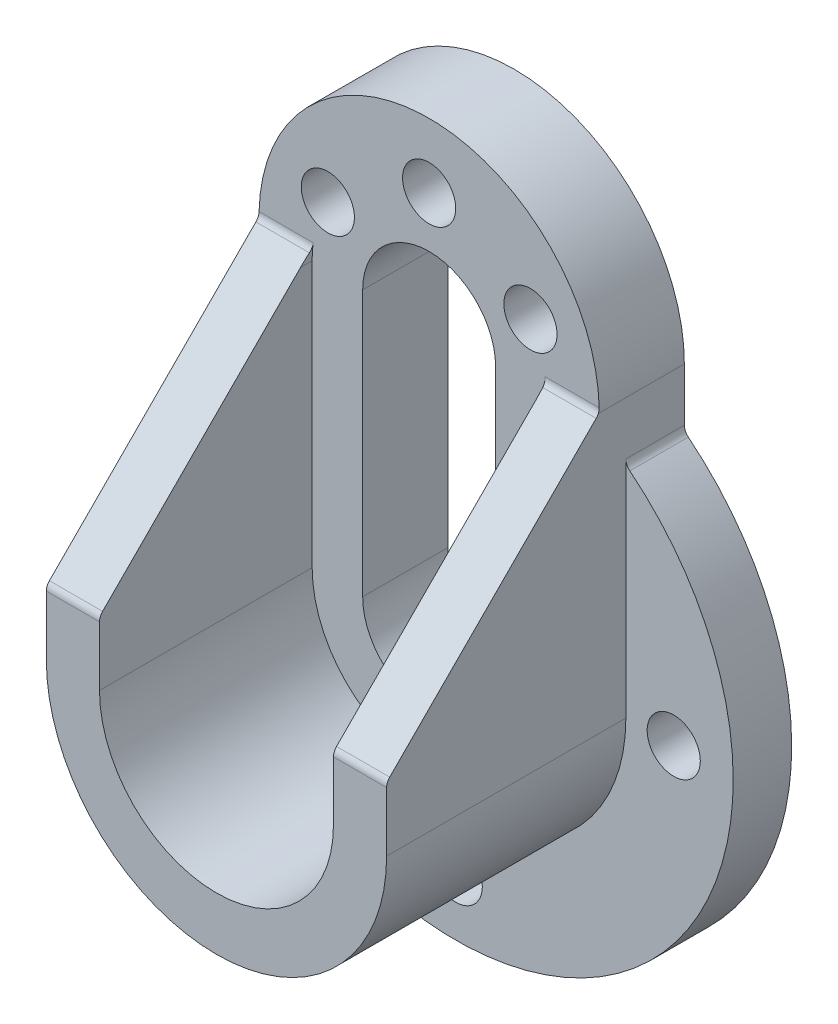
ISO-10303-21;
HEADER;
FILE_DESCRIPTION(('STEP AP214'),'2;1');
FILE_NAME('part.step','',(''),(''),'','','');
FILE_SCHEMA(('AUTOMOTIVE_DESIGN { 1 0 10303 214 1 1 1 1 }'));
ENDSEC;
DATA;
#1=APPLICATION_CONTEXT('core data for automotive mechanical design processes');
#2=APPLICATION_PROTOCOL_DEFINITION('international standard','automotive_design',2000,#1);
#3=PRODUCT_CONTEXT('',#1,'mechanical');
#4=PRODUCT('Part','Part','',(#3));
#5=PRODUCT_RELATED_PRODUCT_CATEGORY('part','',(#4));
#6=PRODUCT_DEFINITION_FORMATION('','',#4);
#7=PRODUCT_DEFINITION_CONTEXT('part definition',#1,'design');
#8=PRODUCT_DEFINITION('design','',#6,#7);
#9=PRODUCT_DEFINITION_SHAPE('','',#8);
#10=(LENGTH_UNIT() NAMED_UNIT(*) SI_UNIT(.MILLI.,.METRE.));
#11=(NAMED_UNIT(*) PLANE_ANGLE_UNIT() SI_UNIT($,.RADIAN.));
#12=(NAMED_UNIT(*) SI_UNIT($,.STERADIAN.) SOLID_ANGLE_UNIT());
#13=UNCERTAINTY_MEASURE_WITH_UNIT(LENGTH_MEASURE(1.E-05),#10,'distance_accuracy_value','');
#14=(GEOMETRIC_REPRESENTATION_CONTEXT(3) GLOBAL_UNCERTAINTY_ASSIGNED_CONTEXT((#13)) GLOBAL_UNIT_ASSIGNED_CONTEXT((#10,
#11,#12)) REPRESENTATION_CONTEXT('',''));
#15=CARTESIAN_POINT('',(0.,0.,0.));
#16=DIRECTION('',(0.,0.,1.));
#17=DIRECTION('',(1.,0.,0.));
#18=AXIS2_PLACEMENT_3D('',#15,#16,#17);
#19=CARTESIAN_POINT('',(0.,50.,0.));
#20=DIRECTION('',(0.,0.,1.));
#21=DIRECTION('',(1.,0.,0.));
#22=AXIS2_PLACEMENT_3D('',#19,#20,#21);
#23=CYLINDRICAL_SURFACE('',#22,22.);
#24=DIRECTION('',(0.,0.,1.));
#25=VECTOR('',#24,1.);
#26=CARTESIAN_POINT('',(22.,50.,0.));
#27=LINE('',#26,#25);
#28=CARTESIAN_POINT('',(22.,50.,0.));
#29=VERTEX_POINT('',#28);
#30=CARTESIAN_POINT('',(22.,50.,2.17761140897928));
#31=VERTEX_POINT('',#30);
#32=EDGE_CURVE('E220',#29,#31,#27,.T.);
#33=ORIENTED_EDGE('',*,*,#32,.T.);
#34=CARTESIAN_POINT('',(0.,50.,2.17761140897929));
#35=DIRECTION('',(0.,-0.705448471756706,-0.70876121063171));
#36=DIRECTION('',(0.,-0.70876121063171,0.705448471756706));
#37=AXIS2_PLACEMENT_3D('',#34,#35,#36);
#38=ELLIPSE('',#37,31.0400733984746,22.);
#39=CARTESIAN_POINT('',(21.9415495077587,51.6026244720994,0.582477578736564));
#40=VERTEX_POINT('',#39);
#41=EDGE_CURVE('E206',#31,#40,#38,.F.);
#42=ORIENTED_EDGE('',*,*,#41,.T.);
#43=CARTESIAN_POINT('',(21.9415495077587,51.6026244720994,0.582477578736581));
#44=CARTESIAN_POINT('',(21.9386403688496,51.6424531020536,0.542835848804801));
#45=CARTESIAN_POINT('',(21.9355020785693,51.6839247776312,0.504901144272656));
#46=CARTESIAN_POINT('',(21.9287339390922,51.7698845092516,0.432670223736206));
#47=CARTESIAN_POINT('',(21.9251041047282,51.8143724742544,0.398373897995576));
#48=CARTESIAN_POINT('',(21.9134315652484,51.951907670187,0.301312631195397));
#49=CARTESIAN_POINT('',(21.9046025785488,52.0490722840365,0.244329639346155));
#50=CARTESIAN_POINT('',(21.8847360056665,52.2513726203151,0.147504672207877));
#51=CARTESIAN_POINT('',(21.873697122173,52.3565130022624,0.107672808899073));
#52=CARTESIAN_POINT('',(21.8494486585541,52.5716228820764,0.0462377916142625));
#53=CARTESIAN_POINT('',(21.8362431988387,52.6815829284529,0.0246005044872213));
#54=CARTESIAN_POINT('',(21.8173707897701,52.8290856105941,0.00817637818528167));
#55=CARTESIAN_POINT('',(21.8125587418083,52.8659507637769,0.00510811691843141));
#56=CARTESIAN_POINT('',(21.8027392904783,52.9397169475892,0.00102244721047741));
#57=CARTESIAN_POINT('',(21.7977321648536,52.9766178591679,2.22433321546773E-06));
#58=CARTESIAN_POINT('',(21.7926292281965,53.0135214156128,0.));
#59=B_SPLINE_CURVE_WITH_KNOTS('',3,(#43,#44,#45,#46,#47,#48,#49,#50,#51,#52,#53,#54,#55,#56,#57,
#58),.UNSPECIFIED.,.F.,.F.,(4,2,2,2,2,2,2,4),(0.,0.168702836620993,0.337400583586161,
0.674603490869276,1.01200493527835,1.34877199108211,1.46064422207649,1.57236261152918),.UNSPECIFIED.);
#60=CARTESIAN_POINT('',(21.7926292281965,53.0135214156128,0.));
#61=VERTEX_POINT('',#60);
#62=EDGE_CURVE('E356',#40,#61,#59,.T.);
#63=ORIENTED_EDGE('',*,*,#62,.T.);
#64=CARTESIAN_POINT('',(0.,50.,0.));
#65=DIRECTION('',(0.,0.,1.));
#66=DIRECTION('',(1.,0.,0.));
#67=AXIS2_PLACEMENT_3D('',#64,#65,#66);
#68=CIRCLE('',#67,22.);
#69=EDGE_CURVE('E434',#29,#61,#68,.T.);
#70=ORIENTED_EDGE('',*,*,#69,.F.);
#71=EDGE_LOOP('',(#33,#42,#63,#70));
#72=FACE_BOUND('',#71,.T.);
#73=ADVANCED_FACE('F35',(#72),#23,.F.);
#74=CARTESIAN_POINT('',(0.,0.,-16.));
#75=DIRECTION('',(0.,0.,1.));
#76=DIRECTION('',(1.,0.,0.));
#77=AXIS2_PLACEMENT_3D('',#74,#75,#76);
#78=CYLINDRICAL_SURFACE('',#77,12.5);
#79=CARTESIAN_POINT('',(0.,0.,0.));
#80=DIRECTION('',(0.,0.,1.));
#81=DIRECTION('',(1.,0.,0.));
#82=AXIS2_PLACEMENT_3D('',#79,#80,#81);
#83=CIRCLE('',#82,12.5);
#84=CARTESIAN_POINT('',(12.5,0.,0.));
#85=VERTEX_POINT('',#84);
#86=CARTESIAN_POINT('',(-12.5,0.,0.));
#87=VERTEX_POINT('',#86);
#88=EDGE_CURVE('E235',#85,#87,#83,.F.);
#89=ORIENTED_EDGE('',*,*,#88,.F.);
#90=DIRECTION('',(0.,0.,1.));
#91=VECTOR('',#90,1.);
#92=CARTESIAN_POINT('',(12.5,0.,-16.));
#93=LINE('',#92,#91);
#94=CARTESIAN_POINT('',(12.5,0.,-16.));
#95=VERTEX_POINT('',#94);
#96=EDGE_CURVE('E249',#95,#85,#93,.T.);
#97=ORIENTED_EDGE('',*,*,#96,.F.);
#98=CARTESIAN_POINT('',(0.,0.,-16.));
#99=DIRECTION('',(0.,0.,1.));
#100=DIRECTION('',(1.,0.,0.));
#101=AXIS2_PLACEMENT_3D('',#98,#99,#100);
#102=CIRCLE('',#101,12.5);
#103=CARTESIAN_POINT('',(-12.5,0.,-16.));
#104=VERTEX_POINT('',#103);
#105=EDGE_CURVE('E237',#104,#95,#102,.T.);
#106=ORIENTED_EDGE('',*,*,#105,.F.);
#107=DIRECTION('',(0.,0.,1.));
#108=VECTOR('',#107,1.);
#109=CARTESIAN_POINT('',(-12.5,0.,-16.));
#110=LINE('',#109,#108);
#111=EDGE_CURVE('E250',#104,#87,#110,.T.);
#112=ORIENTED_EDGE('',*,*,#111,.T.);
#113=EDGE_LOOP('',(#89,#97,#106,#112));
#114=FACE_BOUND('',#113,.T.);
#115=ADVANCED_FACE('F386',(#114),#78,.F.);
#116=CARTESIAN_POINT('',(-12.5,0.,-16.));
#117=DIRECTION('',(-1.,0.,0.));
#118=DIRECTION('',(0.,0.,1.));
#119=AXIS2_PLACEMENT_3D('',#116,#117,#118);
#120=PLANE('',#119);
#121=DIRECTION('',(0.,1.,0.));
#122=VECTOR('',#121,1.);
#123=CARTESIAN_POINT('',(-12.5,0.,0.));
#124=LINE('',#123,#122);
#125=CARTESIAN_POINT('',(-12.5,50.,0.));
#126=VERTEX_POINT('',#125);
#127=EDGE_CURVE('E233',#87,#126,#124,.T.);
#128=ORIENTED_EDGE('',*,*,#127,.F.);
#129=ORIENTED_EDGE('',*,*,#111,.F.);
#130=DIRECTION('',(0.,-1.,0.));
#131=VECTOR('',#130,1.);
#132=CARTESIAN_POINT('',(-12.5,0.,-16.));
#133=LINE('',#132,#131);
#134=CARTESIAN_POINT('',(-12.5,50.,-16.));
#135=VERTEX_POINT('',#134);
#136=EDGE_CURVE('E246',#135,#104,#133,.T.);
#137=ORIENTED_EDGE('',*,*,#136,.F.);
#138=DIRECTION('',(0.,0.,1.));
#139=VECTOR('',#138,1.);
#140=CARTESIAN_POINT('',(-12.5,50.,-16.));
#141=LINE('',#140,#139);
#142=EDGE_CURVE('E254',#135,#126,#141,.T.);
#143=ORIENTED_EDGE('',*,*,#142,.T.);
#144=EDGE_LOOP('',(#128,#129,#137,#143));
#145=FACE_BOUND('',#144,.T.);
#146=ADVANCED_FACE('F382',(#145),#120,.F.);
#147=CARTESIAN_POINT('',(0.,50.,-16.));
#148=DIRECTION('',(0.,0.,1.));
#149=DIRECTION('',(1.,0.,0.));
#150=AXIS2_PLACEMENT_3D('',#147,#148,#149);
#151=CYLINDRICAL_SURFACE('',#150,12.5);
#152=CARTESIAN_POINT('',(0.,50.,0.));
#153=DIRECTION('',(0.,0.,1.));
#154=DIRECTION('',(1.,0.,0.));
#155=AXIS2_PLACEMENT_3D('',#152,#153,#154);
#156=CIRCLE('',#155,12.5);
#157=CARTESIAN_POINT('',(12.5,50.,0.));
#158=VERTEX_POINT('',#157);
#159=EDGE_CURVE('E223',#126,#158,#156,.F.);
#160=ORIENTED_EDGE('',*,*,#159,.F.);
#161=ORIENTED_EDGE('',*,*,#142,.F.);
#162=CARTESIAN_POINT('',(0.,50.,-16.));
#163=DIRECTION('',(0.,0.,1.));
#164=DIRECTION('',(1.,0.,0.));
#165=AXIS2_PLACEMENT_3D('',#162,#163,#164);
#166=CIRCLE('',#165,12.5);
#167=CARTESIAN_POINT('',(12.5,50.,-16.));
#168=VERTEX_POINT('',#167);
#169=EDGE_CURVE('E243',#168,#135,#166,.T.);
#170=ORIENTED_EDGE('',*,*,#169,.F.);
#171=DIRECTION('',(0.,0.,1.));
#172=VECTOR('',#171,1.);
#173=CARTESIAN_POINT('',(12.5,50.,-16.));
#174=LINE('',#173,#172);
#175=EDGE_CURVE('E257',#168,#158,#174,.T.);
#176=ORIENTED_EDGE('',*,*,#175,.T.);
#177=EDGE_LOOP('',(#160,#161,#170,#176));
#178=FACE_BOUND('',#177,.T.);
#179=ADVANCED_FACE('F385',(#178),#151,.F.);
#180=CARTESIAN_POINT('',(12.5,0.,-16.));
#181=DIRECTION('',(1.,0.,0.));
#182=DIRECTION('',(0.,0.,-1.));
#183=AXIS2_PLACEMENT_3D('',#180,#181,#182);
#184=PLANE('',#183);
#185=DIRECTION('',(0.,-1.,0.));
#186=VECTOR('',#185,1.);
#187=CARTESIAN_POINT('',(12.5,0.,0.));
#188=LINE('',#187,#186);
#189=EDGE_CURVE('E299',#158,#85,#188,.T.);
#190=ORIENTED_EDGE('',*,*,#189,.F.);
#191=ORIENTED_EDGE('',*,*,#175,.F.);
#192=DIRECTION('',(0.,1.,0.));
#193=VECTOR('',#192,1.);
#194=CARTESIAN_POINT('',(12.5,0.,-16.));
#195=LINE('',#194,#193);
#196=EDGE_CURVE('E240',#95,#168,#195,.T.);
#197=ORIENTED_EDGE('',*,*,#196,.F.);
#198=ORIENTED_EDGE('',*,*,#96,.T.);
#199=EDGE_LOOP('',(#190,#191,#197,#198));
#200=FACE_BOUND('',#199,.T.);
#201=ADVANCED_FACE('F390',(#200),#184,.F.);
#202=CARTESIAN_POINT('',(32.,0.,40.));
#203=DIRECTION('',(-1.,0.,0.));
#204=DIRECTION('',(0.,0.,1.));
#205=AXIS2_PLACEMENT_3D('',#202,#203,#204);
#206=PLANE('',#205);
#207=DIRECTION('',(0.,1.,0.));
#208=VECTOR('',#207,1.);
#209=CARTESIAN_POINT('',(32.,0.,-5.));
#210=LINE('',#209,#208);
#211=CARTESIAN_POINT('',(32.,0.,-5.));
#212=VERTEX_POINT('',#211);
#213=CARTESIAN_POINT('',(32.,42.193858725362,-5.));
#214=VERTEX_POINT('',#213);
#215=EDGE_CURVE('E50',#212,#214,#210,.T.);
#216=ORIENTED_EDGE('',*,*,#215,.T.);
#217=DIRECTION('',(0.,0.,1.));
#218=VECTOR('',#217,1.);
#219=CARTESIAN_POINT('',(32.,42.193858725362,40.));
#220=LINE('',#219,#218);
#221=CARTESIAN_POINT('',(32.,42.193858725362,-16.));
#222=VERTEX_POINT('',#221);
#223=EDGE_CURVE('E500',#214,#222,#220,.F.);
#224=ORIENTED_EDGE('',*,*,#223,.T.);
#225=DIRECTION('',(0.,1.,0.));
#226=VECTOR('',#225,1.);
#227=CARTESIAN_POINT('',(32.,0.,-16.));
#228=LINE('',#227,#226);
#229=CARTESIAN_POINT('',(32.,52.1878373266161,-16.));
#230=VERTEX_POINT('',#229);
#231=EDGE_CURVE('E270',#222,#230,#228,.T.);
#232=ORIENTED_EDGE('',*,*,#231,.T.);
#233=DIRECTION('',(0.,0.,-1.));
#234=VECTOR('',#233,1.);
#235=CARTESIAN_POINT('',(32.,52.1878373266161,40.));
#236=LINE('',#235,#234);
#237=CARTESIAN_POINT('',(32.,52.1878373266161,0.178394723004564));
#238=VERTEX_POINT('',#237);
#239=EDGE_CURVE('E293',#238,#230,#236,.T.);
#240=ORIENTED_EDGE('',*,*,#239,.F.);
#241=CARTESIAN_POINT('',(32.,53.0135214156128,2.));
#242=DIRECTION('',(-1.,0.,0.));
#243=DIRECTION('',(0.,0.,1.));
#244=AXIS2_PLACEMENT_3D('',#241,#242,#243);
#245=CIRCLE('',#244,2.);
#246=CARTESIAN_POINT('',(32.,51.6026244720994,0.582477578736581));
#247=VERTEX_POINT('',#246);
#248=EDGE_CURVE('E338',#238,#247,#245,.T.);
#249=ORIENTED_EDGE('',*,*,#248,.T.);
#250=DIRECTION('',(0.,0.70876121063171,-0.705448471756706));
#251=VECTOR('',#250,1.);
#252=CARTESIAN_POINT('',(32.,52.1878373266161,0.));
#253=LINE('',#252,#251);
#254=CARTESIAN_POINT('',(32.,12.5852128545167,39.4175224212634));
#255=VERTEX_POINT('',#254);
#256=EDGE_CURVE('E447',#255,#247,#253,.T.);
#257=ORIENTED_EDGE('',*,*,#256,.F.);
#258=CARTESIAN_POINT('',(32.,11.1743159110033,38.));
#259=DIRECTION('',(-1.,0.,0.));
#260=DIRECTION('',(0.,0.,1.));
#261=AXIS2_PLACEMENT_3D('',#258,#259,#260);
#262=CIRCLE('',#261,2.);
#263=CARTESIAN_POINT('',(32.,11.1743159110033,40.));
#264=VERTEX_POINT('',#263);
#265=EDGE_CURVE('E306',#255,#264,#262,.F.);
#266=ORIENTED_EDGE('',*,*,#265,.T.);
#267=DIRECTION('',(0.,1.,0.));
#268=VECTOR('',#267,1.);
#269=CARTESIAN_POINT('',(32.,0.,40.));
#270=LINE('',#269,#268);
#271=CARTESIAN_POINT('',(32.,0.,40.));
#272=VERTEX_POINT('',#271);
#273=EDGE_CURVE('E277',#272,#264,#270,.T.);
#274=ORIENTED_EDGE('',*,*,#273,.F.);
#275=DIRECTION('',(0.,0.,-1.));
#276=VECTOR('',#275,1.);
#277=CARTESIAN_POINT('',(32.,0.,40.));
#278=LINE('',#277,#276);
#279=EDGE_CURVE('E285',#272,#212,#278,.T.);
#280=ORIENTED_EDGE('',*,*,#279,.T.);
#281=EDGE_LOOP('',(#216,#224,#232,#240,#249,#257,#266,#274,#280));
#282=FACE_BOUND('',#281,.T.);
#283=ADVANCED_FACE('F394',(#282),#206,.F.);
#284=CARTESIAN_POINT('',(0.,52.1878373266161,40.));
#285=DIRECTION('',(0.,0.,-1.));
#286=DIRECTION('',(-1.,0.,0.));
#287=AXIS2_PLACEMENT_3D('',#284,#285,#286);
#288=CYLINDRICAL_SURFACE('',#287,32.);
#289=DIRECTION('',(0.,0.,-1.));
#290=VECTOR('',#289,1.);
#291=CARTESIAN_POINT('',(-32.,52.1878373266161,40.));
#292=LINE('',#291,#290);
#293=CARTESIAN_POINT('',(-32.,52.1878373266161,0.178394723004564));
#294=VERTEX_POINT('',#293);
#295=CARTESIAN_POINT('',(-32.,52.1878373266161,-16.));
#296=VERTEX_POINT('',#295);
#297=EDGE_CURVE('E290',#294,#296,#292,.T.);
#298=ORIENTED_EDGE('',*,*,#297,.F.);
#299=CARTESIAN_POINT('',(-32.,52.1878373266161,0.178394723004563));
#300=CARTESIAN_POINT('',(-32.0000012988931,52.239414879399,0.155008894667187));
#301=CARTESIAN_POINT('',(-31.9998753821367,52.2919902326153,0.133825589601059));
#302=CARTESIAN_POINT('',(-31.999349062357,52.3987566278793,0.0959870044649456));
#303=CARTESIAN_POINT('',(-31.9989486039162,52.4529479940133,0.079332639529022));
#304=CARTESIAN_POINT('',(-31.9978627591802,52.561581913256,0.0509362992831871));
#305=CARTESIAN_POINT('',(-31.9971825061449,52.6160032989629,0.039113104588344));
#306=CARTESIAN_POINT('',(-31.9955275820384,52.7256193735883,0.0200495214606834));
#307=CARTESIAN_POINT('',(-31.9945530088057,52.7808137997258,0.0128076125799549));
#308=CARTESIAN_POINT('',(-31.9922365194126,52.8951615636295,0.00262651067096588));
#309=CARTESIAN_POINT('',(-31.9908750577133,52.954341843145,-7.05372248977936E-06));
#310=CARTESIAN_POINT('',(-31.9893458167743,53.0135214156128,0.));
#311=B_SPLINE_CURVE_WITH_KNOTS('',3,(#299,#300,#301,#302,#303,#304,#305,#306,#307,#308,#309,
#310),.UNSPECIFIED.,.F.,.F.,(4,2,2,2,2,4),(0.,0.169842910299552,0.339720114215354,
0.506610613307957,0.673445695291009,0.850977104070458),.UNSPECIFIED.);
#312=CARTESIAN_POINT('',(-31.9893458167743,53.0135214156128,0.));
#313=VERTEX_POINT('',#312);
#314=EDGE_CURVE('E482',#294,#313,#311,.T.);
#315=ORIENTED_EDGE('',*,*,#314,.T.);
#316=CARTESIAN_POINT('',(0.,52.1878373266161,0.));
#317=DIRECTION('',(0.,0.,-1.));
#318=DIRECTION('',(-1.,0.,0.));
#319=AXIS2_PLACEMENT_3D('',#316,#317,#318);
#320=CIRCLE('',#319,32.);
#321=CARTESIAN_POINT('',(31.9893458167743,53.0135214156128,0.));
#322=VERTEX_POINT('',#321);
#323=EDGE_CURVE('E453',#313,#322,#320,.T.);
#324=ORIENTED_EDGE('',*,*,#323,.T.);
#325=CARTESIAN_POINT('',(31.9893458167743,53.0135214156128,0.));
#326=CARTESIAN_POINT('',(31.9908086302432,52.9569086894987,-6.50181150794348E-06));
#327=CARTESIAN_POINT('',(31.992118076294,52.9002924878563,0.00240341217393403));
#328=CARTESIAN_POINT('',(31.9944311171524,52.787450114788,0.01201314846117));
#329=CARTESIAN_POINT('',(31.9954346502064,52.7312240243478,0.0192139369444433));
#330=CARTESIAN_POINT('',(31.9971212015394,52.6205634364177,0.0381941374836962));
#331=CARTESIAN_POINT('',(31.9978095447156,52.5661148200141,0.0498908251818322));
#332=CARTESIAN_POINT('',(31.9989013760483,52.4583982797745,0.0777798836253736));
#333=CARTESIAN_POINT('',(31.9993049587011,52.4051299699493,0.093970760511637));
#334=CARTESIAN_POINT('',(31.9998637847203,52.2967568842851,0.131910106010477));
#335=CARTESIAN_POINT('',(32.0000014473886,52.2417533253237,0.153948336329133));
#336=CARTESIAN_POINT('',(32.,52.1878373266161,0.178394723004562));
#337=B_SPLINE_CURVE_WITH_KNOTS('',3,(#325,#326,#327,#328,#329,#330,#331,#332,#333,#334,#335,
#336),.UNSPECIFIED.,.F.,.F.,(4,2,2,2,2,4),(0.,0.169842919388186,0.339720101590902,
0.506610607172158,0.673445704990136,0.850977103880419),.UNSPECIFIED.);
#338=EDGE_CURVE('E330',#322,#238,#337,.T.);
#339=ORIENTED_EDGE('',*,*,#338,.T.);
#340=ORIENTED_EDGE('',*,*,#239,.T.);
#341=CARTESIAN_POINT('',(0.,52.1878373266161,-16.));
#342=DIRECTION('',(0.,0.,1.));
#343=DIRECTION('',(1.,0.,0.));
#344=AXIS2_PLACEMENT_3D('',#341,#342,#343);
#345=CIRCLE('',#344,32.);
#346=EDGE_CURVE('E272',#230,#296,#345,.T.);
#347=ORIENTED_EDGE('',*,*,#346,.T.);
#348=EDGE_LOOP('',(#298,#315,#324,#339,#340,#347));
#349=FACE_BOUND('',#348,.T.);
#350=ADVANCED_FACE('F340',(#349),#288,.T.);
#351=CARTESIAN_POINT('',(-32.,0.,40.));
#352=DIRECTION('',(-1.,0.,0.));
#353=DIRECTION('',(0.,0.,1.));
#354=AXIS2_PLACEMENT_3D('',#351,#352,#353);
#355=PLANE('',#354);
#356=DIRECTION('',(0.,1.,0.));
#357=VECTOR('',#356,1.);
#358=CARTESIAN_POINT('',(-32.,0.,-16.));
#359=LINE('',#358,#357);
#360=CARTESIAN_POINT('',(-32.,42.193858725362,-16.));
#361=VERTEX_POINT('',#360);
#362=EDGE_CURVE('E275',#361,#296,#359,.T.);
#363=ORIENTED_EDGE('',*,*,#362,.F.);
#364=DIRECTION('',(0.,0.,-1.));
#365=VECTOR('',#364,1.);
#366=CARTESIAN_POINT('',(-32.,42.193858725362,-5.));
#367=LINE('',#366,#365);
#368=CARTESIAN_POINT('',(-32.,42.193858725362,-5.));
#369=VERTEX_POINT('',#368);
#370=EDGE_CURVE('E497',#361,#369,#367,.F.);
#371=ORIENTED_EDGE('',*,*,#370,.T.);
#372=DIRECTION('',(0.,1.,0.));
#373=VECTOR('',#372,1.);
#374=CARTESIAN_POINT('',(-32.,0.,-5.));
#375=LINE('',#374,#373);
#376=CARTESIAN_POINT('',(-32.,0.,-5.));
#377=VERTEX_POINT('',#376);
#378=EDGE_CURVE('E265',#377,#369,#375,.T.);
#379=ORIENTED_EDGE('',*,*,#378,.F.);
#380=DIRECTION('',(0.,0.,-1.));
#381=VECTOR('',#380,1.);
#382=CARTESIAN_POINT('',(-32.,0.,40.));
#383=LINE('',#382,#381);
#384=CARTESIAN_POINT('',(-32.,0.,40.));
#385=VERTEX_POINT('',#384);
#386=EDGE_CURVE('E287',#385,#377,#383,.T.);
#387=ORIENTED_EDGE('',*,*,#386,.F.);
#388=DIRECTION('',(0.,1.,0.));
#389=VECTOR('',#388,1.);
#390=CARTESIAN_POINT('',(-32.,0.,40.));
#391=LINE('',#390,#389);
#392=CARTESIAN_POINT('',(-32.,11.1743159110033,40.));
#393=VERTEX_POINT('',#392);
#394=EDGE_CURVE('E280',#385,#393,#391,.T.);
#395=ORIENTED_EDGE('',*,*,#394,.T.);
#396=CARTESIAN_POINT('',(-32.,11.1743159110033,38.));
#397=DIRECTION('',(-1.,0.,0.));
#398=DIRECTION('',(0.,0.,1.));
#399=AXIS2_PLACEMENT_3D('',#396,#397,#398);
#400=CIRCLE('',#399,2.);
#401=CARTESIAN_POINT('',(-32.,12.5852128545167,39.4175224212634));
#402=VERTEX_POINT('',#401);
#403=EDGE_CURVE('E317',#393,#402,#400,.T.);
#404=ORIENTED_EDGE('',*,*,#403,.T.);
#405=DIRECTION('',(0.,-0.70876121063171,0.705448471756706));
#406=VECTOR('',#405,1.);
#407=CARTESIAN_POINT('',(-32.,5.97189055564647,45.9999341545669));
#408=LINE('',#407,#406);
#409=CARTESIAN_POINT('',(-32.,51.6026244720994,0.582477578736563));
#410=VERTEX_POINT('',#409);
#411=EDGE_CURVE('E214',#410,#402,#408,.T.);
#412=ORIENTED_EDGE('',*,*,#411,.F.);
#413=CARTESIAN_POINT('',(-32.,53.0135214156128,2.));
#414=DIRECTION('',(-1.,0.,0.));
#415=DIRECTION('',(0.,0.,1.));
#416=AXIS2_PLACEMENT_3D('',#413,#414,#415);
#417=CIRCLE('',#416,2.);
#418=EDGE_CURVE('E487',#410,#294,#417,.F.);
#419=ORIENTED_EDGE('',*,*,#418,.T.);
#420=ORIENTED_EDGE('',*,*,#297,.T.);
#421=EDGE_LOOP('',(#363,#371,#379,#387,#395,#404,#412,#419,#420));
#422=FACE_BOUND('',#421,.T.);
#423=ADVANCED_FACE('F417',(#422),#355,.T.);
#424=CARTESIAN_POINT('',(0.,0.,40.));
#425=DIRECTION('',(0.,0.,-1.));
#426=DIRECTION('',(-1.,0.,0.));
#427=AXIS2_PLACEMENT_3D('',#424,#425,#426);
#428=CYLINDRICAL_SURFACE('',#427,32.);
#429=ORIENTED_EDGE('',*,*,#386,.T.);
#430=CARTESIAN_POINT('',(0.,0.,-5.));
#431=DIRECTION('',(0.,0.,1.));
#432=DIRECTION('',(1.,0.,0.));
#433=AXIS2_PLACEMENT_3D('',#430,#431,#432);
#434=CIRCLE('',#433,32.);
#435=EDGE_CURVE('E296',#377,#212,#434,.T.);
#436=ORIENTED_EDGE('',*,*,#435,.T.);
#437=ORIENTED_EDGE('',*,*,#279,.F.);
#438=CARTESIAN_POINT('',(0.,0.,40.));
#439=DIRECTION('',(0.,0.,1.));
#440=DIRECTION('',(1.,0.,0.));
#441=AXIS2_PLACEMENT_3D('',#438,#439,#440);
#442=CIRCLE('',#441,32.);
#443=EDGE_CURVE('E283',#385,#272,#442,.T.);
#444=ORIENTED_EDGE('',*,*,#443,.F.);
#445=EDGE_LOOP('',(#429,#436,#437,#444));
#446=FACE_BOUND('',#445,.T.);
#447=ADVANCED_FACE('F414',(#446),#428,.T.);
#448=CARTESIAN_POINT('',(0.,0.,40.));
#449=DIRECTION('',(0.,0.,1.));
#450=DIRECTION('',(1.,0.,0.));
#451=AXIS2_PLACEMENT_3D('',#448,#449,#450);
#452=PLANE('',#451);
#453=ORIENTED_EDGE('',*,*,#273,.T.);
#454=DIRECTION('',(1.,0.,0.));
#455=VECTOR('',#454,1.);
#456=CARTESIAN_POINT('',(22.,11.1743159110033,40.));
#457=LINE('',#456,#455);
#458=CARTESIAN_POINT('',(22.,11.1743159110033,40.));
#459=VERTEX_POINT('',#458);
#460=EDGE_CURVE('E310',#264,#459,#457,.F.);
#461=ORIENTED_EDGE('',*,*,#460,.T.);
#462=DIRECTION('',(0.,1.,0.));
#463=VECTOR('',#462,1.);
#464=CARTESIAN_POINT('',(22.,0.,40.));
#465=LINE('',#464,#463);
#466=CARTESIAN_POINT('',(22.,0.,40.));
#467=VERTEX_POINT('',#466);
#468=EDGE_CURVE('E465',#467,#459,#465,.T.);
#469=ORIENTED_EDGE('',*,*,#468,.F.);
#470=CARTESIAN_POINT('',(0.,0.,40.));
#471=DIRECTION('',(0.,0.,1.));
#472=DIRECTION('',(1.,0.,0.));
#473=AXIS2_PLACEMENT_3D('',#470,#471,#472);
#474=CIRCLE('',#473,22.);
#475=CARTESIAN_POINT('',(-22.,0.,40.));
#476=VERTEX_POINT('',#475);
#477=EDGE_CURVE('E456',#476,#467,#474,.T.);
#478=ORIENTED_EDGE('',*,*,#477,.F.);
#479=DIRECTION('',(0.,-1.,0.));
#480=VECTOR('',#479,1.);
#481=CARTESIAN_POINT('',(-22.,0.,40.));
#482=LINE('',#481,#480);
#483=CARTESIAN_POINT('',(-22.,11.1743159110033,40.));
#484=VERTEX_POINT('',#483);
#485=EDGE_CURVE('E459',#484,#476,#482,.T.);
#486=ORIENTED_EDGE('',*,*,#485,.F.);
#487=DIRECTION('',(1.,0.,0.));
#488=VECTOR('',#487,1.);
#489=CARTESIAN_POINT('',(-32.,11.1743159110033,40.));
#490=LINE('',#489,#488);
#491=EDGE_CURVE('E308',#484,#393,#490,.F.);
#492=ORIENTED_EDGE('',*,*,#491,.T.);
#493=ORIENTED_EDGE('',*,*,#394,.F.);
#494=ORIENTED_EDGE('',*,*,#443,.T.);
#495=EDGE_LOOP('',(#453,#461,#469,#478,#486,#492,#493,#494));
#496=FACE_BOUND('',#495,.T.);
#497=ADVANCED_FACE('F410',(#496),#452,.T.);
#498=CARTESIAN_POINT('',(0.,0.,-16.));
#499=DIRECTION('',(0.,0.,1.));
#500=DIRECTION('',(1.,0.,0.));
#501=AXIS2_PLACEMENT_3D('',#498,#499,#500);
#502=PLANE('',#501);
#503=CARTESIAN_POINT('',(0.,-41.,-16.));
#504=DIRECTION('',(0.,0.,-1.));
#505=DIRECTION('',(-1.,0.,0.));
#506=AXIS2_PLACEMENT_3D('',#503,#504,#505);
#507=CIRCLE('',#506,4.99999999999999);
#508=CARTESIAN_POINT('',(-4.99999999999999,-41.,-16.));
#509=VERTEX_POINT('',#508);
#510=EDGE_CURVE('E737',#509,#509,#507,.T.);
#511=ORIENTED_EDGE('',*,*,#510,.F.);
#512=EDGE_LOOP('',(#511));
#513=FACE_BOUND('',#512,.T.);
#514=CARTESIAN_POINT('',(-41.,0.,-16.));
#515=DIRECTION('',(0.,0.,-1.));
#516=DIRECTION('',(-1.,0.,0.));
#517=AXIS2_PLACEMENT_3D('',#514,#515,#516);
#518=CIRCLE('',#517,5.);
#519=CARTESIAN_POINT('',(-46.,0.,-16.));
#520=VERTEX_POINT('',#519);
#521=EDGE_CURVE('E739',#520,#520,#518,.T.);
#522=ORIENTED_EDGE('',*,*,#521,.F.);
#523=EDGE_LOOP('',(#522));
#524=FACE_BOUND('',#523,.T.);
#525=CARTESIAN_POINT('',(41.,0.,-16.));
#526=DIRECTION('',(0.,0.,-1.));
#527=DIRECTION('',(-1.,0.,0.));
#528=AXIS2_PLACEMENT_3D('',#525,#526,#527);
#529=CIRCLE('',#528,5.);
#530=CARTESIAN_POINT('',(36.,0.,-16.));
#531=VERTEX_POINT('',#530);
#532=EDGE_CURVE('E747',#531,#531,#529,.T.);
#533=ORIENTED_EDGE('',*,*,#532,.F.);
#534=EDGE_LOOP('',(#533));
#535=FACE_BOUND('',#534,.T.);
#536=CARTESIAN_POINT('',(-19.0525588832576,61.0000000000001,-16.));
#537=DIRECTION('',(0.,0.,1.));
#538=DIRECTION('',(1.,0.,0.));
#539=AXIS2_PLACEMENT_3D('',#536,#537,#538);
#540=CIRCLE('',#539,5.);
#541=CARTESIAN_POINT('',(-14.0525588832576,61.0000000000001,-16.));
#542=VERTEX_POINT('',#541);
#543=EDGE_CURVE('E756',#542,#542,#540,.T.);
#544=ORIENTED_EDGE('',*,*,#543,.T.);
#545=EDGE_LOOP('',(#544));
#546=FACE_BOUND('',#545,.T.);
#547=CARTESIAN_POINT('',(19.0525588832576,61.,-16.));
#548=DIRECTION('',(0.,0.,1.));
#549=DIRECTION('',(1.,0.,0.));
#550=AXIS2_PLACEMENT_3D('',#547,#548,#549);
#551=CIRCLE('',#550,4.99999999999999);
#552=CARTESIAN_POINT('',(24.0525588832576,61.,-16.));
#553=VERTEX_POINT('',#552);
#554=EDGE_CURVE('E762',#553,#553,#551,.T.);
#555=ORIENTED_EDGE('',*,*,#554,.T.);
#556=EDGE_LOOP('',(#555));
#557=FACE_BOUND('',#556,.T.);
#558=CARTESIAN_POINT('',(0.,72.,-16.));
#559=DIRECTION('',(0.,0.,1.));
#560=DIRECTION('',(1.,0.,0.));
#561=AXIS2_PLACEMENT_3D('',#558,#559,#560);
#562=CIRCLE('',#561,5.);
#563=CARTESIAN_POINT('',(5.,72.,-16.));
#564=VERTEX_POINT('',#563);
#565=EDGE_CURVE('E448',#564,#564,#562,.T.);
#566=ORIENTED_EDGE('',*,*,#565,.T.);
#567=EDGE_LOOP('',(#566));
#568=FACE_BOUND('',#567,.T.);
#569=ORIENTED_EDGE('',*,*,#136,.T.);
#570=ORIENTED_EDGE('',*,*,#105,.T.);
#571=ORIENTED_EDGE('',*,*,#196,.T.);
#572=ORIENTED_EDGE('',*,*,#169,.T.);
#573=EDGE_LOOP('',(#569,#570,#571,#572));
#574=FACE_BOUND('',#573,.T.);
#575=ORIENTED_EDGE('',*,*,#231,.F.);
#576=CARTESIAN_POINT('',(34.,42.193858725362,-16.));
#577=DIRECTION('',(0.,0.,1.));
#578=DIRECTION('',(1.,0.,0.));
#579=AXIS2_PLACEMENT_3D('',#576,#577,#578);
#580=CIRCLE('',#579,2.);
#581=CARTESIAN_POINT('',(32.7451058511501,40.6365403008956,-16.));
#582=VERTEX_POINT('',#581);
#583=EDGE_CURVE('E43',#222,#582,#580,.T.);
#584=ORIENTED_EDGE('',*,*,#583,.T.);
#585=CARTESIAN_POINT('',(0.,0.,-16.));
#586=DIRECTION('',(0.,0.,1.));
#587=DIRECTION('',(1.,0.,0.));
#588=AXIS2_PLACEMENT_3D('',#585,#586,#587);
#589=CIRCLE('',#588,52.1878373266161);
#590=CARTESIAN_POINT('',(-32.7451058511501,40.6365403008956,-16.));
#591=VERTEX_POINT('',#590);
#592=EDGE_CURVE('E262',#591,#582,#589,.T.);
#593=ORIENTED_EDGE('',*,*,#592,.F.);
#594=CARTESIAN_POINT('',(-34.,42.193858725362,-16.));
#595=DIRECTION('',(0.,0.,1.));
#596=DIRECTION('',(1.,0.,0.));
#597=AXIS2_PLACEMENT_3D('',#594,#595,#596);
#598=CIRCLE('',#597,2.);
#599=EDGE_CURVE('E502',#591,#361,#598,.T.);
#600=ORIENTED_EDGE('',*,*,#599,.T.);
#601=ORIENTED_EDGE('',*,*,#362,.T.);
#602=ORIENTED_EDGE('',*,*,#346,.F.);
#603=EDGE_LOOP('',(#575,#584,#593,#600,#601,#602));
#604=FACE_BOUND('',#603,.T.);
#605=ADVANCED_FACE('F406',(#513,#524,#535,#546,#557,#568,#574,#604),#502,.F.);
#606=CARTESIAN_POINT('',(0.,0.,-16.));
#607=DIRECTION('',(0.,0.,1.));
#608=DIRECTION('',(1.,0.,0.));
#609=AXIS2_PLACEMENT_3D('',#606,#607,#608);
#610=CYLINDRICAL_SURFACE('',#609,52.1878373266161);
#611=CARTESIAN_POINT('',(0.,0.,-5.));
#612=DIRECTION('',(0.,0.,1.));
#613=DIRECTION('',(1.,0.,0.));
#614=AXIS2_PLACEMENT_3D('',#611,#612,#613);
#615=CIRCLE('',#614,52.1878373266161);
#616=CARTESIAN_POINT('',(-32.7451058511501,40.6365403008956,-5.));
#617=VERTEX_POINT('',#616);
#618=CARTESIAN_POINT('',(32.7451058511501,40.6365403008956,-5.));
#619=VERTEX_POINT('',#618);
#620=EDGE_CURVE('E253',#617,#619,#615,.T.);
#621=ORIENTED_EDGE('',*,*,#620,.F.);
#622=DIRECTION('',(0.,0.,1.));
#623=VECTOR('',#622,1.);
#624=CARTESIAN_POINT('',(-32.7451058511501,40.6365403008957,-16.));
#625=LINE('',#624,#623);
#626=EDGE_CURVE('E489',#617,#591,#625,.F.);
#627=ORIENTED_EDGE('',*,*,#626,.T.);
#628=ORIENTED_EDGE('',*,*,#592,.T.);
#629=DIRECTION('',(0.,0.,1.));
#630=VECTOR('',#629,1.);
#631=CARTESIAN_POINT('',(32.7451058511501,40.6365403008957,-16.));
#632=LINE('',#631,#630);
#633=EDGE_CURVE('E486',#582,#619,#632,.T.);
#634=ORIENTED_EDGE('',*,*,#633,.T.);
#635=EDGE_LOOP('',(#621,#627,#628,#634));
#636=FACE_BOUND('',#635,.T.);
#637=ADVANCED_FACE('F402',(#636),#610,.T.);
#638=CARTESIAN_POINT('',(0.,0.,-5.));
#639=DIRECTION('',(0.,0.,1.));
#640=DIRECTION('',(1.,0.,0.));
#641=AXIS2_PLACEMENT_3D('',#638,#639,#640);
#642=PLANE('',#641);
#643=CARTESIAN_POINT('',(0.,-41.,-5.));
#644=DIRECTION('',(0.,0.,1.));
#645=DIRECTION('',(1.,0.,0.));
#646=AXIS2_PLACEMENT_3D('',#643,#644,#645);
#647=CIRCLE('',#646,4.99999999999999);
#648=CARTESIAN_POINT('',(4.99999999999999,-41.,-5.));
#649=VERTEX_POINT('',#648);
#650=EDGE_CURVE('E734',#649,#649,#647,.T.);
#651=ORIENTED_EDGE('',*,*,#650,.F.);
#652=EDGE_LOOP('',(#651));
#653=FACE_BOUND('',#652,.T.);
#654=CARTESIAN_POINT('',(-41.,0.,-5.));
#655=DIRECTION('',(0.,0.,1.));
#656=DIRECTION('',(1.,0.,0.));
#657=AXIS2_PLACEMENT_3D('',#654,#655,#656);
#658=CIRCLE('',#657,4.99999999999999);
#659=CARTESIAN_POINT('',(-36.,0.,-5.));
#660=VERTEX_POINT('',#659);
#661=EDGE_CURVE('E744',#660,#660,#658,.T.);
#662=ORIENTED_EDGE('',*,*,#661,.F.);
#663=EDGE_LOOP('',(#662));
#664=FACE_BOUND('',#663,.T.);
#665=CARTESIAN_POINT('',(41.,0.,-5.));
#666=DIRECTION('',(0.,0.,1.));
#667=DIRECTION('',(1.,0.,0.));
#668=AXIS2_PLACEMENT_3D('',#665,#666,#667);
#669=CIRCLE('',#668,4.99999999999999);
#670=CARTESIAN_POINT('',(46.,0.,-5.));
#671=VERTEX_POINT('',#670);
#672=EDGE_CURVE('E750',#671,#671,#669,.T.);
#673=ORIENTED_EDGE('',*,*,#672,.F.);
#674=EDGE_LOOP('',(#673));
#675=FACE_BOUND('',#674,.T.);
#676=ORIENTED_EDGE('',*,*,#215,.F.);
#677=ORIENTED_EDGE('',*,*,#435,.F.);
#678=ORIENTED_EDGE('',*,*,#378,.T.);
#679=CARTESIAN_POINT('',(-34.,42.193858725362,-5.));
#680=DIRECTION('',(0.,0.,1.));
#681=DIRECTION('',(1.,0.,0.));
#682=AXIS2_PLACEMENT_3D('',#679,#680,#681);
#683=CIRCLE('',#682,2.);
#684=EDGE_CURVE('E504',#369,#617,#683,.F.);
#685=ORIENTED_EDGE('',*,*,#684,.T.);
#686=ORIENTED_EDGE('',*,*,#620,.T.);
#687=CARTESIAN_POINT('',(34.,42.193858725362,-5.));
#688=DIRECTION('',(0.,0.,1.));
#689=DIRECTION('',(1.,0.,0.));
#690=AXIS2_PLACEMENT_3D('',#687,#688,#689);
#691=CIRCLE('',#690,2.);
#692=EDGE_CURVE('E11',#619,#214,#691,.F.);
#693=ORIENTED_EDGE('',*,*,#692,.T.);
#694=EDGE_LOOP('',(#676,#677,#678,#685,#686,#693));
#695=FACE_BOUND('',#694,.T.);
#696=ADVANCED_FACE('F399',(#653,#664,#675,#695),#642,.T.);
#697=CARTESIAN_POINT('',(0.,0.,0.));
#698=DIRECTION('',(0.,0.,1.));
#699=DIRECTION('',(1.,0.,0.));
#700=AXIS2_PLACEMENT_3D('',#697,#698,#699);
#701=PLANE('',#700);
#702=CARTESIAN_POINT('',(-19.0525588832576,61.0000000000001,0.));
#703=DIRECTION('',(0.,0.,1.));
#704=DIRECTION('',(1.,0.,0.));
#705=AXIS2_PLACEMENT_3D('',#702,#703,#704);
#706=CIRCLE('',#705,5.);
#707=CARTESIAN_POINT('',(-14.0525588832576,61.0000000000001,0.));
#708=VERTEX_POINT('',#707);
#709=EDGE_CURVE('E753',#708,#708,#706,.T.);
#710=ORIENTED_EDGE('',*,*,#709,.F.);
#711=EDGE_LOOP('',(#710));
#712=FACE_BOUND('',#711,.T.);
#713=CARTESIAN_POINT('',(19.0525588832576,61.,0.));
#714=DIRECTION('',(0.,0.,1.));
#715=DIRECTION('',(1.,0.,0.));
#716=AXIS2_PLACEMENT_3D('',#713,#714,#715);
#717=CIRCLE('',#716,5.);
#718=CARTESIAN_POINT('',(24.0525588832576,61.,0.));
#719=VERTEX_POINT('',#718);
#720=EDGE_CURVE('E759',#719,#719,#717,.T.);
#721=ORIENTED_EDGE('',*,*,#720,.F.);
#722=EDGE_LOOP('',(#721));
#723=FACE_BOUND('',#722,.T.);
#724=CARTESIAN_POINT('',(0.,72.,0.));
#725=DIRECTION('',(0.,0.,1.));
#726=DIRECTION('',(1.,0.,0.));
#727=AXIS2_PLACEMENT_3D('',#724,#725,#726);
#728=CIRCLE('',#727,5.);
#729=CARTESIAN_POINT('',(5.,72.,0.));
#730=VERTEX_POINT('',#729);
#731=EDGE_CURVE('E765',#730,#730,#728,.T.);
#732=ORIENTED_EDGE('',*,*,#731,.F.);
#733=EDGE_LOOP('',(#732));
#734=FACE_BOUND('',#733,.T.);
#735=ORIENTED_EDGE('',*,*,#159,.T.);
#736=ORIENTED_EDGE('',*,*,#189,.T.);
#737=ORIENTED_EDGE('',*,*,#88,.T.);
#738=ORIENTED_EDGE('',*,*,#127,.T.);
#739=EDGE_LOOP('',(#735,#736,#737,#738));
#740=FACE_BOUND('',#739,.T.);
#741=ORIENTED_EDGE('',*,*,#69,.T.);
#742=DIRECTION('',(1.,0.,0.));
#743=VECTOR('',#742,1.);
#744=CARTESIAN_POINT('',(0.,53.0135214156128,0.));
#745=LINE('',#744,#743);
#746=EDGE_CURVE('E323',#61,#322,#745,.T.);
#747=ORIENTED_EDGE('',*,*,#746,.T.);
#748=ORIENTED_EDGE('',*,*,#323,.F.);
#749=DIRECTION('',(1.,0.,0.));
#750=VECTOR('',#749,1.);
#751=CARTESIAN_POINT('',(0.,53.0135214156128,0.));
#752=LINE('',#751,#750);
#753=CARTESIAN_POINT('',(-21.7926292281965,53.0135214156128,0.));
#754=VERTEX_POINT('',#753);
#755=EDGE_CURVE('E320',#313,#754,#752,.T.);
#756=ORIENTED_EDGE('',*,*,#755,.T.);
#757=CARTESIAN_POINT('',(-22.,50.,0.));
#758=VERTEX_POINT('',#757);
#759=EDGE_CURVE('E461',#754,#758,#68,.T.);
#760=ORIENTED_EDGE('',*,*,#759,.T.);
#761=DIRECTION('',(0.,-1.,0.));
#762=VECTOR('',#761,1.);
#763=CARTESIAN_POINT('',(-22.,0.,0.));
#764=LINE('',#763,#762);
#765=CARTESIAN_POINT('',(-22.,0.,0.));
#766=VERTEX_POINT('',#765);
#767=EDGE_CURVE('E218',#758,#766,#764,.T.);
#768=ORIENTED_EDGE('',*,*,#767,.T.);
#769=CARTESIAN_POINT('',(0.,0.,0.));
#770=DIRECTION('',(0.,0.,1.));
#771=DIRECTION('',(1.,0.,0.));
#772=AXIS2_PLACEMENT_3D('',#769,#770,#771);
#773=CIRCLE('',#772,22.);
#774=CARTESIAN_POINT('',(22.,0.,0.));
#775=VERTEX_POINT('',#774);
#776=EDGE_CURVE('E457',#766,#775,#773,.T.);
#777=ORIENTED_EDGE('',*,*,#776,.T.);
#778=DIRECTION('',(0.,1.,0.));
#779=VECTOR('',#778,1.);
#780=CARTESIAN_POINT('',(22.,0.,0.));
#781=LINE('',#780,#779);
#782=EDGE_CURVE('E438',#775,#29,#781,.T.);
#783=ORIENTED_EDGE('',*,*,#782,.T.);
#784=EDGE_LOOP('',(#741,#747,#748,#756,#760,#768,#777,#783));
#785=FACE_BOUND('',#784,.T.);
#786=ADVANCED_FACE('F380',(#712,#723,#734,#740,#785),#701,.T.);
#787=CARTESIAN_POINT('',(0.,0.,0.));
#788=DIRECTION('',(0.,0.,1.));
#789=DIRECTION('',(1.,0.,0.));
#790=AXIS2_PLACEMENT_3D('',#787,#788,#789);
#791=CYLINDRICAL_SURFACE('',#790,22.);
#792=ORIENTED_EDGE('',*,*,#477,.T.);
#793=DIRECTION('',(0.,0.,1.));
#794=VECTOR('',#793,1.);
#795=CARTESIAN_POINT('',(22.,0.,0.));
#796=LINE('',#795,#794);
#797=EDGE_CURVE('E226',#775,#467,#796,.T.);
#798=ORIENTED_EDGE('',*,*,#797,.F.);
#799=ORIENTED_EDGE('',*,*,#776,.F.);
#800=DIRECTION('',(0.,0.,1.));
#801=VECTOR('',#800,1.);
#802=CARTESIAN_POINT('',(-22.,0.,0.));
#803=LINE('',#802,#801);
#804=EDGE_CURVE('E219',#766,#476,#803,.T.);
#805=ORIENTED_EDGE('',*,*,#804,.T.);
#806=EDGE_LOOP('',(#792,#798,#799,#805));
#807=FACE_BOUND('',#806,.T.);
#808=ADVANCED_FACE('F377',(#807),#791,.F.);
#809=CARTESIAN_POINT('',(-22.,0.,0.));
#810=DIRECTION('',(-1.,0.,0.));
#811=DIRECTION('',(0.,-1.,0.));
#812=AXIS2_PLACEMENT_3D('',#809,#810,#811);
#813=PLANE('',#812);
#814=DIRECTION('',(0.,-0.70876121063171,0.705448471756706));
#815=VECTOR('',#814,1.);
#816=CARTESIAN_POINT('',(-22.,25.9716710708694,26.093632302412));
#817=LINE('',#816,#815);
#818=CARTESIAN_POINT('',(-22.,50.,2.17761140897929));
#819=VERTEX_POINT('',#818);
#820=CARTESIAN_POINT('',(-22.,12.5852128545167,39.4175224212634));
#821=VERTEX_POINT('',#820);
#822=EDGE_CURVE('E205',#819,#821,#817,.T.);
#823=ORIENTED_EDGE('',*,*,#822,.T.);
#824=CARTESIAN_POINT('',(-22.,11.1743159110033,38.));
#825=DIRECTION('',(-1.,0.,0.));
#826=DIRECTION('',(0.,-1.,0.));
#827=AXIS2_PLACEMENT_3D('',#824,#825,#826);
#828=CIRCLE('',#827,2.);
#829=EDGE_CURVE('E315',#821,#484,#828,.F.);
#830=ORIENTED_EDGE('',*,*,#829,.T.);
#831=ORIENTED_EDGE('',*,*,#485,.T.);
#832=ORIENTED_EDGE('',*,*,#804,.F.);
#833=ORIENTED_EDGE('',*,*,#767,.F.);
#834=DIRECTION('',(0.,0.,1.));
#835=VECTOR('',#834,1.);
#836=CARTESIAN_POINT('',(-22.,50.,0.));
#837=LINE('',#836,#835);
#838=EDGE_CURVE('E199',#758,#819,#837,.T.);
#839=ORIENTED_EDGE('',*,*,#838,.T.);
#840=EDGE_LOOP('',(#823,#830,#831,#832,#833,#839));
#841=FACE_BOUND('',#840,.T.);
#842=ADVANCED_FACE('F216',(#841),#813,.F.);
#843=ORIENTED_EDGE('',*,*,#759,.F.);
#844=CARTESIAN_POINT('',(-21.7926292281965,53.0135214156128,0.));
#845=CARTESIAN_POINT('',(-21.8003785144754,52.9574900019528,9.62079263019809E-07));
#846=CARTESIAN_POINT('',(-21.8079054728796,52.9014547356337,0.00235636778762494));
#847=CARTESIAN_POINT('',(-21.822480492917,52.789715660262,0.0117698625604017));
#848=CARTESIAN_POINT('',(-21.8295285331527,52.7340118661206,0.018828161593689));
#849=CARTESIAN_POINT('',(-21.8499033610744,52.5679020978473,0.0470497999491785));
#850=CARTESIAN_POINT('',(-21.862459173674,52.4585099411642,0.0752598777134859));
#851=CARTESIAN_POINT('',(-21.8853359444425,52.2457883476561,0.149776951967302));
#852=CARTESIAN_POINT('',(-21.8956547700527,52.1424647639092,0.196101100014824));
#853=CARTESIAN_POINT('',(-21.9140677503991,51.9451033110764,0.305551023408348));
#854=CARTESIAN_POINT('',(-21.9221667910838,51.8510453448863,0.368639286179425));
#855=CARTESIAN_POINT('',(-21.9314951472653,51.7350272979888,0.461575668493107));
#856=CARTESIAN_POINT('',(-21.9336438625383,51.7076275141698,0.484766207881601));
#857=CARTESIAN_POINT('',(-21.9377422732826,51.6541396622806,0.532566245021363));
#858=CARTESIAN_POINT('',(-21.9396922086058,51.62805003312,0.557173975254748));
#859=CARTESIAN_POINT('',(-21.9415495077588,51.6026244720994,0.582477578736576));
#860=B_SPLINE_CURVE_WITH_KNOTS('',3,(#844,#845,#846,#847,#848,#849,#850,#851,#852,#853,#854,
#855,#856,#857,#858,#859),.UNSPECIFIED.,.F.,.F.,(4,2,2,2,2,2,2,4),(0.,0.16959114388347,
0.339189859966664,0.678423782942267,1.01797969509141,1.35678209941613,1.46462720157344,
1.57234059589602),.UNSPECIFIED.);
#861=CARTESIAN_POINT('',(-21.9415495077588,51.6026244720994,0.58247757873658));
#862=VERTEX_POINT('',#861);
#863=EDGE_CURVE('E202',#754,#862,#860,.T.);
#864=ORIENTED_EDGE('',*,*,#863,.T.);
#865=EDGE_CURVE('E195',#862,#819,#38,.F.);
#866=ORIENTED_EDGE('',*,*,#865,.T.);
#867=ORIENTED_EDGE('',*,*,#838,.F.);
#868=EDGE_LOOP('',(#843,#864,#866,#867));
#869=FACE_BOUND('',#868,.T.);
#870=ADVANCED_FACE('F197',(#869),#23,.F.);
#871=CARTESIAN_POINT('',(22.,0.,0.));
#872=DIRECTION('',(1.,0.,0.));
#873=DIRECTION('',(0.,1.,0.));
#874=AXIS2_PLACEMENT_3D('',#871,#872,#873);
#875=PLANE('',#874);
#876=ORIENTED_EDGE('',*,*,#468,.T.);
#877=CARTESIAN_POINT('',(22.,11.1743159110033,38.));
#878=DIRECTION('',(1.,0.,0.));
#879=DIRECTION('',(0.,1.,0.));
#880=AXIS2_PLACEMENT_3D('',#877,#878,#879);
#881=CIRCLE('',#880,2.);
#882=CARTESIAN_POINT('',(22.,12.5852128545167,39.4175224212634));
#883=VERTEX_POINT('',#882);
#884=EDGE_CURVE('E312',#459,#883,#881,.F.);
#885=ORIENTED_EDGE('',*,*,#884,.T.);
#886=DIRECTION('',(0.,0.70876121063171,-0.705448471756706));
#887=VECTOR('',#886,1.);
#888=CARTESIAN_POINT('',(22.,25.9716710708694,26.093632302412));
#889=LINE('',#888,#887);
#890=EDGE_CURVE('E301',#883,#31,#889,.T.);
#891=ORIENTED_EDGE('',*,*,#890,.T.);
#892=ORIENTED_EDGE('',*,*,#32,.F.);
#893=ORIENTED_EDGE('',*,*,#782,.F.);
#894=ORIENTED_EDGE('',*,*,#797,.T.);
#895=EDGE_LOOP('',(#876,#885,#891,#892,#893,#894));
#896=FACE_BOUND('',#895,.T.);
#897=ADVANCED_FACE('F371',(#896),#875,.F.);
#898=CARTESIAN_POINT('',(-52.1878373266161,52.1878373266161,0.));
#899=DIRECTION('',(0.,-0.705448471756706,-0.70876121063171));
#900=DIRECTION('',(0.,0.70876121063171,-0.705448471756706));
#901=AXIS2_PLACEMENT_3D('',#898,#899,#900);
#902=PLANE('',#901);
#903=ORIENTED_EDGE('',*,*,#865,.F.);
#904=DIRECTION('',(1.,0.,0.));
#905=VECTOR('',#904,1.);
#906=CARTESIAN_POINT('',(-52.1878373266161,51.6026244720994,0.582477578736581));
#907=LINE('',#906,#905);
#908=EDGE_CURVE('E328',#862,#410,#907,.F.);
#909=ORIENTED_EDGE('',*,*,#908,.T.);
#910=ORIENTED_EDGE('',*,*,#411,.T.);
#911=DIRECTION('',(1.,0.,0.));
#912=VECTOR('',#911,1.);
#913=CARTESIAN_POINT('',(-22.,12.5852128545167,39.4175224212634));
#914=LINE('',#913,#912);
#915=EDGE_CURVE('E212',#402,#821,#914,.T.);
#916=ORIENTED_EDGE('',*,*,#915,.T.);
#917=ORIENTED_EDGE('',*,*,#822,.F.);
#918=EDGE_LOOP('',(#903,#909,#910,#916,#917));
#919=FACE_BOUND('',#918,.T.);
#920=ADVANCED_FACE('F210',(#919),#902,.F.);
#921=ORIENTED_EDGE('',*,*,#256,.T.);
#922=DIRECTION('',(1.,0.,0.));
#923=VECTOR('',#922,1.);
#924=CARTESIAN_POINT('',(-52.1878373266161,51.6026244720994,0.582477578736581));
#925=LINE('',#924,#923);
#926=EDGE_CURVE('E326',#247,#40,#925,.F.);
#927=ORIENTED_EDGE('',*,*,#926,.T.);
#928=ORIENTED_EDGE('',*,*,#41,.F.);
#929=ORIENTED_EDGE('',*,*,#890,.F.);
#930=DIRECTION('',(1.,0.,0.));
#931=VECTOR('',#930,1.);
#932=CARTESIAN_POINT('',(32.,12.5852128545167,39.4175224212634));
#933=LINE('',#932,#931);
#934=EDGE_CURVE('E303',#883,#255,#933,.T.);
#935=ORIENTED_EDGE('',*,*,#934,.T.);
#936=EDGE_LOOP('',(#921,#927,#928,#929,#935));
#937=FACE_BOUND('',#936,.T.);
#938=ADVANCED_FACE('F445',(#937),#902,.F.);
#939=CARTESIAN_POINT('',(-52.1878373266161,11.1743159110033,38.));
#940=DIRECTION('',(-1.,0.,0.));
#941=DIRECTION('',(0.,0.,1.));
#942=AXIS2_PLACEMENT_3D('',#939,#940,#941);
#943=CYLINDRICAL_SURFACE('',#942,2.);
#944=ORIENTED_EDGE('',*,*,#884,.F.);
#945=ORIENTED_EDGE('',*,*,#460,.F.);
#946=ORIENTED_EDGE('',*,*,#265,.F.);
#947=ORIENTED_EDGE('',*,*,#934,.F.);
#948=EDGE_LOOP('',(#944,#945,#946,#947));
#949=FACE_BOUND('',#948,.T.);
#950=ADVANCED_FACE('F473',(#949),#943,.T.);
#951=CARTESIAN_POINT('',(-52.1878373266161,11.1743159110033,38.));
#952=DIRECTION('',(-1.,0.,0.));
#953=DIRECTION('',(0.,0.,1.));
#954=AXIS2_PLACEMENT_3D('',#951,#952,#953);
#955=CYLINDRICAL_SURFACE('',#954,2.);
#956=ORIENTED_EDGE('',*,*,#403,.F.);
#957=ORIENTED_EDGE('',*,*,#491,.F.);
#958=ORIENTED_EDGE('',*,*,#829,.F.);
#959=ORIENTED_EDGE('',*,*,#915,.F.);
#960=EDGE_LOOP('',(#956,#957,#958,#959));
#961=FACE_BOUND('',#960,.T.);
#962=ADVANCED_FACE('F352',(#961),#955,.T.);
#963=CARTESIAN_POINT('',(0.,72.,0.));
#964=DIRECTION('',(0.,0.,1.));
#965=DIRECTION('',(1.,0.,0.));
#966=AXIS2_PLACEMENT_3D('',#963,#964,#965);
#967=CYLINDRICAL_SURFACE('',#966,5.);
#968=ORIENTED_EDGE('',*,*,#565,.F.);
#969=EDGE_LOOP('',(#968));
#970=FACE_BOUND('',#969,.T.);
#971=ORIENTED_EDGE('',*,*,#731,.T.);
#972=EDGE_LOOP('',(#971));
#973=FACE_BOUND('',#972,.T.);
#974=ADVANCED_FACE('F525',(#970,#973),#967,.F.);
#975=CARTESIAN_POINT('',(19.0525588832576,61.,0.));
#976=DIRECTION('',(0.,0.,1.));
#977=DIRECTION('',(1.,0.,0.));
#978=AXIS2_PLACEMENT_3D('',#975,#976,#977);
#979=CYLINDRICAL_SURFACE('',#978,5.);
#980=ORIENTED_EDGE('',*,*,#554,.F.);
#981=EDGE_LOOP('',(#980));
#982=FACE_BOUND('',#981,.T.);
#983=ORIENTED_EDGE('',*,*,#720,.T.);
#984=EDGE_LOOP('',(#983));
#985=FACE_BOUND('',#984,.T.);
#986=ADVANCED_FACE('F530',(#982,#985),#979,.F.);
#987=CARTESIAN_POINT('',(-19.0525588832576,61.0000000000001,0.));
#988=DIRECTION('',(0.,0.,1.));
#989=DIRECTION('',(1.,0.,0.));
#990=AXIS2_PLACEMENT_3D('',#987,#988,#989);
#991=CYLINDRICAL_SURFACE('',#990,5.);
#992=ORIENTED_EDGE('',*,*,#543,.F.);
#993=EDGE_LOOP('',(#992));
#994=FACE_BOUND('',#993,.T.);
#995=ORIENTED_EDGE('',*,*,#709,.T.);
#996=EDGE_LOOP('',(#995));
#997=FACE_BOUND('',#996,.T.);
#998=ADVANCED_FACE('F691',(#994,#997),#991,.F.);
#999=CARTESIAN_POINT('',(41.,0.,-16.));
#1000=DIRECTION('',(0.,0.,-1.));
#1001=DIRECTION('',(-1.,0.,0.));
#1002=AXIS2_PLACEMENT_3D('',#999,#1000,#1001);
#1003=CYLINDRICAL_SURFACE('',#1002,4.99999999999999);
#1004=ORIENTED_EDGE('',*,*,#672,.T.);
#1005=EDGE_LOOP('',(#1004));
#1006=FACE_BOUND('',#1005,.T.);
#1007=ORIENTED_EDGE('',*,*,#532,.T.);
#1008=EDGE_LOOP('',(#1007));
#1009=FACE_BOUND('',#1008,.T.);
#1010=ADVANCED_FACE('F701',(#1006,#1009),#1003,.F.);
#1011=CARTESIAN_POINT('',(-41.,0.,-16.));
#1012=DIRECTION('',(0.,0.,-1.));
#1013=DIRECTION('',(-1.,0.,0.));
#1014=AXIS2_PLACEMENT_3D('',#1011,#1012,#1013);
#1015=CYLINDRICAL_SURFACE('',#1014,4.99999999999999);
#1016=ORIENTED_EDGE('',*,*,#661,.T.);
#1017=EDGE_LOOP('',(#1016));
#1018=FACE_BOUND('',#1017,.T.);
#1019=ORIENTED_EDGE('',*,*,#521,.T.);
#1020=EDGE_LOOP('',(#1019));
#1021=FACE_BOUND('',#1020,.T.);
#1022=ADVANCED_FACE('F711',(#1018,#1021),#1015,.F.);
#1023=CARTESIAN_POINT('',(0.,-41.,-16.));
#1024=DIRECTION('',(0.,0.,-1.));
#1025=DIRECTION('',(-1.,0.,0.));
#1026=AXIS2_PLACEMENT_3D('',#1023,#1024,#1025);
#1027=CYLINDRICAL_SURFACE('',#1026,4.99999999999999);
#1028=ORIENTED_EDGE('',*,*,#650,.T.);
#1029=EDGE_LOOP('',(#1028));
#1030=FACE_BOUND('',#1029,.T.);
#1031=ORIENTED_EDGE('',*,*,#510,.T.);
#1032=EDGE_LOOP('',(#1031));
#1033=FACE_BOUND('',#1032,.T.);
#1034=ADVANCED_FACE('F350',(#1030,#1033),#1027,.F.);
#1035=CARTESIAN_POINT('',(0.,53.0135214156128,2.));
#1036=DIRECTION('',(1.,0.,0.));
#1037=DIRECTION('',(0.,0.,-1.));
#1038=AXIS2_PLACEMENT_3D('',#1035,#1036,#1037);
#1039=CYLINDRICAL_SURFACE('',#1038,2.);
#1040=ORIENTED_EDGE('',*,*,#62,.F.);
#1041=ORIENTED_EDGE('',*,*,#926,.F.);
#1042=ORIENTED_EDGE('',*,*,#248,.F.);
#1043=ORIENTED_EDGE('',*,*,#338,.F.);
#1044=ORIENTED_EDGE('',*,*,#746,.F.);
#1045=EDGE_LOOP('',(#1040,#1041,#1042,#1043,#1044));
#1046=FACE_BOUND('',#1045,.T.);
#1047=ADVANCED_FACE('F344',(#1046),#1039,.F.);
#1048=CARTESIAN_POINT('',(0.,53.0135214156128,2.));
#1049=DIRECTION('',(1.,0.,0.));
#1050=DIRECTION('',(0.,0.,-1.));
#1051=AXIS2_PLACEMENT_3D('',#1048,#1049,#1050);
#1052=CYLINDRICAL_SURFACE('',#1051,2.);
#1053=ORIENTED_EDGE('',*,*,#418,.F.);
#1054=ORIENTED_EDGE('',*,*,#908,.F.);
#1055=ORIENTED_EDGE('',*,*,#863,.F.);
#1056=ORIENTED_EDGE('',*,*,#755,.F.);
#1057=ORIENTED_EDGE('',*,*,#314,.F.);
#1058=EDGE_LOOP('',(#1053,#1054,#1055,#1056,#1057));
#1059=FACE_BOUND('',#1058,.T.);
#1060=ADVANCED_FACE('F349',(#1059),#1052,.F.);
#1061=CARTESIAN_POINT('',(-34.,42.193858725362,-16.));
#1062=DIRECTION('',(0.,0.,1.));
#1063=DIRECTION('',(1.,0.,0.));
#1064=AXIS2_PLACEMENT_3D('',#1061,#1062,#1063);
#1065=CYLINDRICAL_SURFACE('',#1064,2.);
#1066=ORIENTED_EDGE('',*,*,#684,.F.);
#1067=ORIENTED_EDGE('',*,*,#370,.F.);
#1068=ORIENTED_EDGE('',*,*,#599,.F.);
#1069=ORIENTED_EDGE('',*,*,#626,.F.);
#1070=EDGE_LOOP('',(#1066,#1067,#1068,#1069));
#1071=FACE_BOUND('',#1070,.T.);
#1072=ADVANCED_FACE('F515',(#1071),#1065,.F.);
#1073=CARTESIAN_POINT('',(34.,42.193858725362,-16.));
#1074=DIRECTION('',(0.,0.,1.));
#1075=DIRECTION('',(1.,0.,0.));
#1076=AXIS2_PLACEMENT_3D('',#1073,#1074,#1075);
#1077=CYLINDRICAL_SURFACE('',#1076,2.);
#1078=ORIENTED_EDGE('',*,*,#692,.F.);
#1079=ORIENTED_EDGE('',*,*,#633,.F.);
#1080=ORIENTED_EDGE('',*,*,#583,.F.);
#1081=ORIENTED_EDGE('',*,*,#223,.F.);
#1082=EDGE_LOOP('',(#1078,#1079,#1080,#1081));
#1083=FACE_BOUND('',#1082,.T.);
#1084=ADVANCED_FACE('F37',(#1083),#1077,.F.);
#1085=CLOSED_SHELL('',(#73,#115,#146,#179,#201,#283,#350,#423,#447,#497,#605,#637,#696,#786,
#808,#842,#870,#897,#920,#938,#950,#962,#974,#986,#998,#1010,#1022,#1034,#1047,#1060,#1072,#1084));
#1086=MANIFOLD_SOLID_BREP('B2',#1085);
#1087=ADVANCED_BREP_SHAPE_REPRESENTATION('',(#18,#1086),#14);
#1088=SHAPE_DEFINITION_REPRESENTATION(#9,#1087);
ENDSEC;
END-ISO-10303-21;
